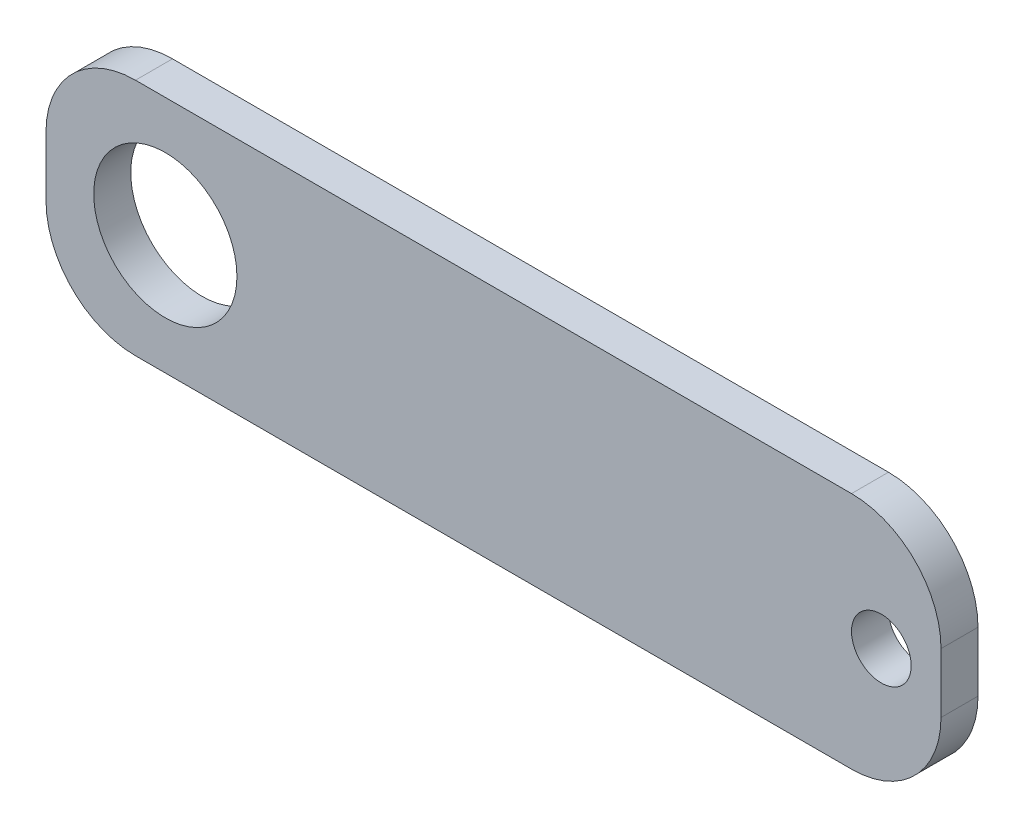
ISO-10303-21;
HEADER;
FILE_DESCRIPTION(('STEP AP214'),'2;1');
FILE_NAME('part.step','',(''),(''),'','','');
FILE_SCHEMA(('AUTOMOTIVE_DESIGN { 1 0 10303 214 1 1 1 1 }'));
ENDSEC;
DATA;
#1=APPLICATION_CONTEXT('core data for automotive mechanical design processes');
#2=APPLICATION_PROTOCOL_DEFINITION('international standard','automotive_design',2000,#1);
#3=PRODUCT_CONTEXT('',#1,'mechanical');
#4=PRODUCT('Part','Part','',(#3));
#5=PRODUCT_RELATED_PRODUCT_CATEGORY('part','',(#4));
#6=PRODUCT_DEFINITION_FORMATION('','',#4);
#7=PRODUCT_DEFINITION_CONTEXT('part definition',#1,'design');
#8=PRODUCT_DEFINITION('design','',#6,#7);
#9=PRODUCT_DEFINITION_SHAPE('','',#8);
#10=(LENGTH_UNIT() NAMED_UNIT(*) SI_UNIT(.MILLI.,.METRE.));
#11=(NAMED_UNIT(*) PLANE_ANGLE_UNIT() SI_UNIT($,.RADIAN.));
#12=(NAMED_UNIT(*) SI_UNIT($,.STERADIAN.) SOLID_ANGLE_UNIT());
#13=UNCERTAINTY_MEASURE_WITH_UNIT(LENGTH_MEASURE(1.E-05),#10,'distance_accuracy_value','');
#14=(GEOMETRIC_REPRESENTATION_CONTEXT(3) GLOBAL_UNCERTAINTY_ASSIGNED_CONTEXT((#13)) GLOBAL_UNIT_ASSIGNED_CONTEXT((#10,
#11,#12)) REPRESENTATION_CONTEXT('',''));
#15=CARTESIAN_POINT('',(0.,0.,0.));
#16=DIRECTION('',(0.,0.,1.));
#17=DIRECTION('',(1.,0.,0.));
#18=AXIS2_PLACEMENT_3D('',#15,#16,#17);
#19=CARTESIAN_POINT('',(0.,0.,3.1));
#20=DIRECTION('',(0.,0.,-1.));
#21=DIRECTION('',(-1.,0.,0.));
#22=AXIS2_PLACEMENT_3D('',#19,#20,#21);
#23=PLANE('',#22);
#24=CARTESIAN_POINT('',(42.3806232903625,0.,3.1));
#25=DIRECTION('',(0.,0.,1.));
#26=DIRECTION('',(-1.,0.,0.));
#27=AXIS2_PLACEMENT_3D('',#24,#25,#26);
#28=CIRCLE('',#27,2.5);
#29=CARTESIAN_POINT('',(39.8806232903625,0.,3.1));
#30=VERTEX_POINT('',#29);
#31=EDGE_CURVE('E134',#30,#30,#28,.T.);
#32=ORIENTED_EDGE('',*,*,#31,.F.);
#33=EDGE_LOOP('',(#32));
#34=FACE_BOUND('',#33,.T.);
#35=DIRECTION('',(0.,-1.,0.));
#36=VECTOR('',#35,1.);
#37=CARTESIAN_POINT('',(-27.6193767096375,-9.99999999999998,3.1));
#38=LINE('',#37,#36);
#39=CARTESIAN_POINT('',(-27.6193767096375,2.50000000000003,3.1));
#40=VERTEX_POINT('',#39);
#41=CARTESIAN_POINT('',(-27.6193767096375,-2.49999999999998,3.1));
#42=VERTEX_POINT('',#41);
#43=EDGE_CURVE('E139',#40,#42,#38,.T.);
#44=ORIENTED_EDGE('',*,*,#43,.T.);
#45=CARTESIAN_POINT('',(-20.1193767096375,-2.49999999999998,3.1));
#46=DIRECTION('',(0.,0.,-1.));
#47=DIRECTION('',(-1.,0.,0.));
#48=AXIS2_PLACEMENT_3D('',#45,#46,#47);
#49=CIRCLE('',#48,7.5);
#50=CARTESIAN_POINT('',(-20.1193767096375,-9.99999999999998,3.1));
#51=VERTEX_POINT('',#50);
#52=EDGE_CURVE('E153',#42,#51,#49,.F.);
#53=ORIENTED_EDGE('',*,*,#52,.T.);
#54=DIRECTION('',(1.,0.,0.));
#55=VECTOR('',#54,1.);
#56=CARTESIAN_POINT('',(-27.6193767096375,-9.99999999999998,3.1));
#57=LINE('',#56,#55);
#58=CARTESIAN_POINT('',(39.8806232903625,-9.99999999999998,3.1));
#59=VERTEX_POINT('',#58);
#60=EDGE_CURVE('E120',#51,#59,#57,.T.);
#61=ORIENTED_EDGE('',*,*,#60,.T.);
#62=CARTESIAN_POINT('',(39.8806232903625,-2.49999999999998,3.1));
#63=DIRECTION('',(0.,0.,-1.));
#64=DIRECTION('',(-1.,0.,0.));
#65=AXIS2_PLACEMENT_3D('',#62,#63,#64);
#66=CIRCLE('',#65,7.5);
#67=CARTESIAN_POINT('',(47.3806232903625,-2.49999999999998,3.1));
#68=VERTEX_POINT('',#67);
#69=EDGE_CURVE('E149',#59,#68,#66,.F.);
#70=ORIENTED_EDGE('',*,*,#69,.T.);
#71=DIRECTION('',(0.,1.,0.));
#72=VECTOR('',#71,1.);
#73=CARTESIAN_POINT('',(47.3806232903625,-9.99999999999998,3.1));
#74=LINE('',#73,#72);
#75=CARTESIAN_POINT('',(47.3806232903625,2.50000000000002,3.1));
#76=VERTEX_POINT('',#75);
#77=EDGE_CURVE('E162',#68,#76,#74,.T.);
#78=ORIENTED_EDGE('',*,*,#77,.T.);
#79=CARTESIAN_POINT('',(39.8806232903624,2.50000000000002,3.1));
#80=DIRECTION('',(0.,0.,-1.));
#81=DIRECTION('',(-1.,0.,0.));
#82=AXIS2_PLACEMENT_3D('',#79,#80,#81);
#83=CIRCLE('',#82,7.5);
#84=CARTESIAN_POINT('',(39.8806232903624,10.,3.1));
#85=VERTEX_POINT('',#84);
#86=EDGE_CURVE('E55',#76,#85,#83,.F.);
#87=ORIENTED_EDGE('',*,*,#86,.T.);
#88=DIRECTION('',(-1.,0.,0.));
#89=VECTOR('',#88,1.);
#90=CARTESIAN_POINT('',(-27.6193767096375,10.,3.1));
#91=LINE('',#90,#89);
#92=CARTESIAN_POINT('',(-20.1193767096375,10.,3.1));
#93=VERTEX_POINT('',#92);
#94=EDGE_CURVE('E140',#85,#93,#91,.T.);
#95=ORIENTED_EDGE('',*,*,#94,.T.);
#96=CARTESIAN_POINT('',(-20.1193767096375,2.50000000000003,3.1));
#97=DIRECTION('',(0.,0.,-1.));
#98=DIRECTION('',(-1.,0.,0.));
#99=AXIS2_PLACEMENT_3D('',#96,#97,#98);
#100=CIRCLE('',#99,7.5);
#101=EDGE_CURVE('E151',#93,#40,#100,.F.);
#102=ORIENTED_EDGE('',*,*,#101,.T.);
#103=EDGE_LOOP('',(#44,#53,#61,#70,#78,#87,#95,#102));
#104=FACE_BOUND('',#103,.T.);
#105=CARTESIAN_POINT('',(-17.6193767096375,0.,3.1));
#106=DIRECTION('',(0.,0.,1.));
#107=DIRECTION('',(1.,0.,0.));
#108=AXIS2_PLACEMENT_3D('',#105,#106,#107);
#109=CIRCLE('',#108,6.);
#110=CARTESIAN_POINT('',(-11.6193767096375,0.,3.1));
#111=VERTEX_POINT('',#110);
#112=EDGE_CURVE('E185',#111,#111,#109,.T.);
#113=ORIENTED_EDGE('',*,*,#112,.F.);
#114=EDGE_LOOP('',(#113));
#115=FACE_BOUND('',#114,.T.);
#116=ADVANCED_FACE('F33',(#34,#104,#115),#23,.F.);
#117=CARTESIAN_POINT('',(0.,0.,0.));
#118=DIRECTION('',(0.,0.,-1.));
#119=DIRECTION('',(-1.,0.,0.));
#120=AXIS2_PLACEMENT_3D('',#117,#118,#119);
#121=PLANE('',#120);
#122=CARTESIAN_POINT('',(42.3806232903625,0.,0.));
#123=DIRECTION('',(0.,0.,1.));
#124=DIRECTION('',(-1.,0.,0.));
#125=AXIS2_PLACEMENT_3D('',#122,#123,#124);
#126=CIRCLE('',#125,2.5);
#127=CARTESIAN_POINT('',(39.8806232903625,0.,0.));
#128=VERTEX_POINT('',#127);
#129=EDGE_CURVE('E182',#128,#128,#126,.T.);
#130=ORIENTED_EDGE('',*,*,#129,.T.);
#131=EDGE_LOOP('',(#130));
#132=FACE_BOUND('',#131,.T.);
#133=DIRECTION('',(1.,0.,0.));
#134=VECTOR('',#133,1.);
#135=CARTESIAN_POINT('',(-27.6193767096375,-9.99999999999998,0.));
#136=LINE('',#135,#134);
#137=CARTESIAN_POINT('',(-20.1193767096375,-9.99999999999998,0.));
#138=VERTEX_POINT('',#137);
#139=CARTESIAN_POINT('',(39.8806232903625,-9.99999999999998,0.));
#140=VERTEX_POINT('',#139);
#141=EDGE_CURVE('E117',#138,#140,#136,.T.);
#142=ORIENTED_EDGE('',*,*,#141,.F.);
#143=CARTESIAN_POINT('',(-20.1193767096375,-2.49999999999998,0.));
#144=DIRECTION('',(0.,0.,-1.));
#145=DIRECTION('',(-1.,0.,0.));
#146=AXIS2_PLACEMENT_3D('',#143,#144,#145);
#147=CIRCLE('',#146,7.5);
#148=CARTESIAN_POINT('',(-27.6193767096375,-2.49999999999998,0.));
#149=VERTEX_POINT('',#148);
#150=EDGE_CURVE('E100',#138,#149,#147,.T.);
#151=ORIENTED_EDGE('',*,*,#150,.T.);
#152=DIRECTION('',(0.,-1.,0.));
#153=VECTOR('',#152,1.);
#154=CARTESIAN_POINT('',(-27.6193767096375,-9.99999999999998,0.));
#155=LINE('',#154,#153);
#156=CARTESIAN_POINT('',(-27.6193767096375,2.50000000000003,0.));
#157=VERTEX_POINT('',#156);
#158=EDGE_CURVE('E129',#157,#149,#155,.T.);
#159=ORIENTED_EDGE('',*,*,#158,.F.);
#160=CARTESIAN_POINT('',(-20.1193767096375,2.50000000000003,0.));
#161=DIRECTION('',(0.,0.,-1.));
#162=DIRECTION('',(-1.,0.,0.));
#163=AXIS2_PLACEMENT_3D('',#160,#161,#162);
#164=CIRCLE('',#163,7.5);
#165=CARTESIAN_POINT('',(-20.1193767096375,10.,0.));
#166=VERTEX_POINT('',#165);
#167=EDGE_CURVE('E111',#157,#166,#164,.T.);
#168=ORIENTED_EDGE('',*,*,#167,.T.);
#169=DIRECTION('',(-1.,0.,0.));
#170=VECTOR('',#169,1.);
#171=CARTESIAN_POINT('',(-27.6193767096375,10.,0.));
#172=LINE('',#171,#170);
#173=CARTESIAN_POINT('',(39.8806232903624,10.,0.));
#174=VERTEX_POINT('',#173);
#175=EDGE_CURVE('E132',#174,#166,#172,.T.);
#176=ORIENTED_EDGE('',*,*,#175,.F.);
#177=CARTESIAN_POINT('',(39.8806232903624,2.50000000000002,0.));
#178=DIRECTION('',(0.,0.,-1.));
#179=DIRECTION('',(-1.,0.,0.));
#180=AXIS2_PLACEMENT_3D('',#177,#178,#179);
#181=CIRCLE('',#180,7.5);
#182=CARTESIAN_POINT('',(47.3806232903625,2.50000000000002,0.));
#183=VERTEX_POINT('',#182);
#184=EDGE_CURVE('E121',#174,#183,#181,.T.);
#185=ORIENTED_EDGE('',*,*,#184,.T.);
#186=DIRECTION('',(0.,1.,0.));
#187=VECTOR('',#186,1.);
#188=CARTESIAN_POINT('',(47.3806232903625,-9.99999999999998,0.));
#189=LINE('',#188,#187);
#190=CARTESIAN_POINT('',(47.3806232903625,-2.49999999999998,0.));
#191=VERTEX_POINT('',#190);
#192=EDGE_CURVE('E128',#191,#183,#189,.T.);
#193=ORIENTED_EDGE('',*,*,#192,.F.);
#194=CARTESIAN_POINT('',(39.8806232903625,-2.49999999999998,0.));
#195=DIRECTION('',(0.,0.,-1.));
#196=DIRECTION('',(-1.,0.,0.));
#197=AXIS2_PLACEMENT_3D('',#194,#195,#196);
#198=CIRCLE('',#197,7.5);
#199=EDGE_CURVE('E127',#191,#140,#198,.T.);
#200=ORIENTED_EDGE('',*,*,#199,.T.);
#201=EDGE_LOOP('',(#142,#151,#159,#168,#176,#185,#193,#200));
#202=FACE_BOUND('',#201,.T.);
#203=CARTESIAN_POINT('',(-17.6193767096375,0.,0.));
#204=DIRECTION('',(0.,0.,1.));
#205=DIRECTION('',(1.,0.,0.));
#206=AXIS2_PLACEMENT_3D('',#203,#204,#205);
#207=CIRCLE('',#206,6.);
#208=CARTESIAN_POINT('',(-11.6193767096375,0.,0.));
#209=VERTEX_POINT('',#208);
#210=EDGE_CURVE('E188',#209,#209,#207,.T.);
#211=ORIENTED_EDGE('',*,*,#210,.T.);
#212=EDGE_LOOP('',(#211));
#213=FACE_BOUND('',#212,.T.);
#214=ADVANCED_FACE('F124',(#132,#202,#213),#121,.T.);
#215=CARTESIAN_POINT('',(-27.6193767096375,-9.99999999999998,3.1));
#216=DIRECTION('',(1.,0.,0.));
#217=DIRECTION('',(0.,0.,-1.));
#218=AXIS2_PLACEMENT_3D('',#215,#216,#217);
#219=PLANE('',#218);
#220=ORIENTED_EDGE('',*,*,#158,.T.);
#221=DIRECTION('',(0.,0.,-1.));
#222=VECTOR('',#221,1.);
#223=CARTESIAN_POINT('',(-27.6193767096375,-2.49999999999998,3.1));
#224=LINE('',#223,#222);
#225=EDGE_CURVE('E105',#149,#42,#224,.F.);
#226=ORIENTED_EDGE('',*,*,#225,.T.);
#227=ORIENTED_EDGE('',*,*,#43,.F.);
#228=DIRECTION('',(0.,0.,-1.));
#229=VECTOR('',#228,1.);
#230=CARTESIAN_POINT('',(-27.6193767096375,2.50000000000003,3.1));
#231=LINE('',#230,#229);
#232=EDGE_CURVE('E110',#40,#157,#231,.T.);
#233=ORIENTED_EDGE('',*,*,#232,.T.);
#234=EDGE_LOOP('',(#220,#226,#227,#233));
#235=FACE_BOUND('',#234,.T.);
#236=ADVANCED_FACE('F178',(#235),#219,.F.);
#237=CARTESIAN_POINT('',(-27.6193767096375,-9.99999999999998,3.1));
#238=DIRECTION('',(0.,1.,0.));
#239=DIRECTION('',(-1.,0.,0.));
#240=AXIS2_PLACEMENT_3D('',#237,#238,#239);
#241=PLANE('',#240);
#242=ORIENTED_EDGE('',*,*,#60,.F.);
#243=DIRECTION('',(0.,0.,-1.));
#244=VECTOR('',#243,1.);
#245=CARTESIAN_POINT('',(-20.1193767096375,-9.99999999999998,3.1));
#246=LINE('',#245,#244);
#247=EDGE_CURVE('E104',#51,#138,#246,.T.);
#248=ORIENTED_EDGE('',*,*,#247,.T.);
#249=ORIENTED_EDGE('',*,*,#141,.T.);
#250=DIRECTION('',(0.,0.,-1.));
#251=VECTOR('',#250,1.);
#252=CARTESIAN_POINT('',(39.8806232903625,-9.99999999999998,3.1));
#253=LINE('',#252,#251);
#254=EDGE_CURVE('E122',#140,#59,#253,.F.);
#255=ORIENTED_EDGE('',*,*,#254,.T.);
#256=EDGE_LOOP('',(#242,#248,#249,#255));
#257=FACE_BOUND('',#256,.T.);
#258=ADVANCED_FACE('F116',(#257),#241,.F.);
#259=CARTESIAN_POINT('',(47.3806232903625,-9.99999999999998,3.1));
#260=DIRECTION('',(-1.,0.,0.));
#261=DIRECTION('',(0.,0.,1.));
#262=AXIS2_PLACEMENT_3D('',#259,#260,#261);
#263=PLANE('',#262);
#264=ORIENTED_EDGE('',*,*,#77,.F.);
#265=DIRECTION('',(0.,0.,-1.));
#266=VECTOR('',#265,1.);
#267=CARTESIAN_POINT('',(47.3806232903625,-2.49999999999998,3.1));
#268=LINE('',#267,#266);
#269=EDGE_CURVE('E11',#68,#191,#268,.T.);
#270=ORIENTED_EDGE('',*,*,#269,.T.);
#271=ORIENTED_EDGE('',*,*,#192,.T.);
#272=DIRECTION('',(0.,0.,-1.));
#273=VECTOR('',#272,1.);
#274=CARTESIAN_POINT('',(47.3806232903625,2.50000000000002,3.1));
#275=LINE('',#274,#273);
#276=EDGE_CURVE('E41',#183,#76,#275,.F.);
#277=ORIENTED_EDGE('',*,*,#276,.T.);
#278=EDGE_LOOP('',(#264,#270,#271,#277));
#279=FACE_BOUND('',#278,.T.);
#280=ADVANCED_FACE('F161',(#279),#263,.F.);
#281=CARTESIAN_POINT('',(-27.6193767096375,10.,3.1));
#282=DIRECTION('',(0.,-1.,0.));
#283=DIRECTION('',(1.,0.,0.));
#284=AXIS2_PLACEMENT_3D('',#281,#282,#283);
#285=PLANE('',#284);
#286=ORIENTED_EDGE('',*,*,#175,.T.);
#287=DIRECTION('',(0.,0.,-1.));
#288=VECTOR('',#287,1.);
#289=CARTESIAN_POINT('',(-20.1193767096375,10.,3.1));
#290=LINE('',#289,#288);
#291=EDGE_CURVE('E48',#166,#93,#290,.F.);
#292=ORIENTED_EDGE('',*,*,#291,.T.);
#293=ORIENTED_EDGE('',*,*,#94,.F.);
#294=DIRECTION('',(0.,0.,-1.));
#295=VECTOR('',#294,1.);
#296=CARTESIAN_POINT('',(39.8806232903624,10.,3.1));
#297=LINE('',#296,#295);
#298=EDGE_CURVE('E155',#85,#174,#297,.T.);
#299=ORIENTED_EDGE('',*,*,#298,.T.);
#300=EDGE_LOOP('',(#286,#292,#293,#299));
#301=FACE_BOUND('',#300,.T.);
#302=ADVANCED_FACE('F171',(#301),#285,.F.);
#303=CARTESIAN_POINT('',(42.3806232903625,0.,3.1));
#304=DIRECTION('',(0.,0.,-1.));
#305=DIRECTION('',(-1.,0.,0.));
#306=AXIS2_PLACEMENT_3D('',#303,#304,#305);
#307=CYLINDRICAL_SURFACE('',#306,2.5);
#308=ORIENTED_EDGE('',*,*,#31,.T.);
#309=EDGE_LOOP('',(#308));
#310=FACE_BOUND('',#309,.T.);
#311=ORIENTED_EDGE('',*,*,#129,.F.);
#312=EDGE_LOOP('',(#311));
#313=FACE_BOUND('',#312,.T.);
#314=ADVANCED_FACE('F206',(#310,#313),#307,.F.);
#315=CARTESIAN_POINT('',(-17.6193767096375,0.,3.1));
#316=DIRECTION('',(0.,0.,-1.));
#317=DIRECTION('',(-1.,0.,0.));
#318=AXIS2_PLACEMENT_3D('',#315,#316,#317);
#319=CYLINDRICAL_SURFACE('',#318,6.);
#320=ORIENTED_EDGE('',*,*,#112,.T.);
#321=EDGE_LOOP('',(#320));
#322=FACE_BOUND('',#321,.T.);
#323=ORIENTED_EDGE('',*,*,#210,.F.);
#324=EDGE_LOOP('',(#323));
#325=FACE_BOUND('',#324,.T.);
#326=ADVANCED_FACE('F194',(#322,#325),#319,.F.);
#327=CARTESIAN_POINT('',(-20.1193767096375,-2.49999999999998,3.1));
#328=DIRECTION('',(0.,0.,-1.));
#329=DIRECTION('',(-1.,0.,0.));
#330=AXIS2_PLACEMENT_3D('',#327,#328,#329);
#331=CYLINDRICAL_SURFACE('',#330,7.5);
#332=ORIENTED_EDGE('',*,*,#52,.F.);
#333=ORIENTED_EDGE('',*,*,#225,.F.);
#334=ORIENTED_EDGE('',*,*,#150,.F.);
#335=ORIENTED_EDGE('',*,*,#247,.F.);
#336=EDGE_LOOP('',(#332,#333,#334,#335));
#337=FACE_BOUND('',#336,.T.);
#338=ADVANCED_FACE('F103',(#337),#331,.T.);
#339=CARTESIAN_POINT('',(-20.1193767096375,2.50000000000003,3.1));
#340=DIRECTION('',(0.,0.,-1.));
#341=DIRECTION('',(-1.,0.,0.));
#342=AXIS2_PLACEMENT_3D('',#339,#340,#341);
#343=CYLINDRICAL_SURFACE('',#342,7.5);
#344=ORIENTED_EDGE('',*,*,#101,.F.);
#345=ORIENTED_EDGE('',*,*,#291,.F.);
#346=ORIENTED_EDGE('',*,*,#167,.F.);
#347=ORIENTED_EDGE('',*,*,#232,.F.);
#348=EDGE_LOOP('',(#344,#345,#346,#347));
#349=FACE_BOUND('',#348,.T.);
#350=ADVANCED_FACE('F175',(#349),#343,.T.);
#351=CARTESIAN_POINT('',(39.8806232903625,-2.49999999999998,3.1));
#352=DIRECTION('',(0.,0.,-1.));
#353=DIRECTION('',(-1.,0.,0.));
#354=AXIS2_PLACEMENT_3D('',#351,#352,#353);
#355=CYLINDRICAL_SURFACE('',#354,7.5);
#356=ORIENTED_EDGE('',*,*,#69,.F.);
#357=ORIENTED_EDGE('',*,*,#254,.F.);
#358=ORIENTED_EDGE('',*,*,#199,.F.);
#359=ORIENTED_EDGE('',*,*,#269,.F.);
#360=EDGE_LOOP('',(#356,#357,#358,#359));
#361=FACE_BOUND('',#360,.T.);
#362=ADVANCED_FACE('F220',(#361),#355,.T.);
#363=CARTESIAN_POINT('',(39.8806232903624,2.50000000000002,3.1));
#364=DIRECTION('',(0.,0.,-1.));
#365=DIRECTION('',(-1.,0.,0.));
#366=AXIS2_PLACEMENT_3D('',#363,#364,#365);
#367=CYLINDRICAL_SURFACE('',#366,7.5);
#368=ORIENTED_EDGE('',*,*,#86,.F.);
#369=ORIENTED_EDGE('',*,*,#276,.F.);
#370=ORIENTED_EDGE('',*,*,#184,.F.);
#371=ORIENTED_EDGE('',*,*,#298,.F.);
#372=EDGE_LOOP('',(#368,#369,#370,#371));
#373=FACE_BOUND('',#372,.T.);
#374=ADVANCED_FACE('F35',(#373),#367,.T.);
#375=CLOSED_SHELL('',(#116,#214,#236,#258,#280,#302,#314,#326,#338,#350,#362,#374));
#376=MANIFOLD_SOLID_BREP('B2',#375);
#377=ADVANCED_BREP_SHAPE_REPRESENTATION('',(#18,#376),#14);
#378=SHAPE_DEFINITION_REPRESENTATION(#9,#377);
ENDSEC;
END-ISO-10303-21;
